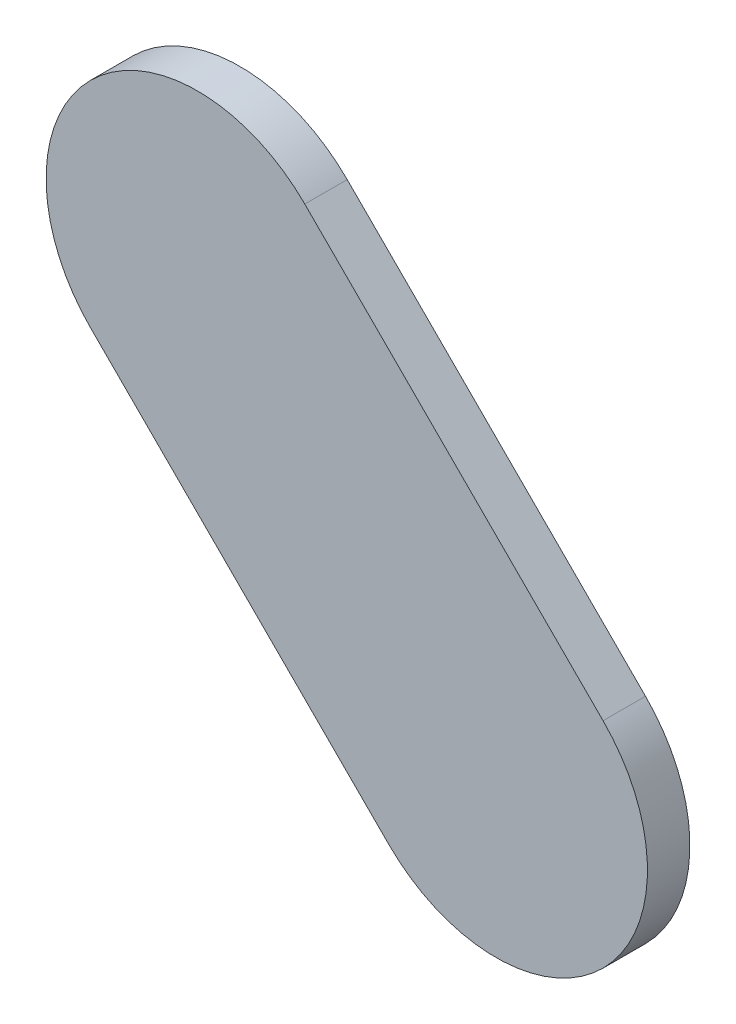
ISO-10303-21;
HEADER;
FILE_DESCRIPTION(('STEP AP214'),'2;1');
FILE_NAME('part.step','',(''),(''),'','','');
FILE_SCHEMA(('AUTOMOTIVE_DESIGN { 1 0 10303 214 1 1 1 1 }'));
ENDSEC;
DATA;
#1=APPLICATION_CONTEXT('core data for automotive mechanical design processes');
#2=APPLICATION_PROTOCOL_DEFINITION('international standard','automotive_design',2000,#1);
#3=PRODUCT_CONTEXT('',#1,'mechanical');
#4=PRODUCT('Part','Part','',(#3));
#5=PRODUCT_RELATED_PRODUCT_CATEGORY('part','',(#4));
#6=PRODUCT_DEFINITION_FORMATION('','',#4);
#7=PRODUCT_DEFINITION_CONTEXT('part definition',#1,'design');
#8=PRODUCT_DEFINITION('design','',#6,#7);
#9=PRODUCT_DEFINITION_SHAPE('','',#8);
#10=(LENGTH_UNIT() NAMED_UNIT(*) SI_UNIT(.MILLI.,.METRE.));
#11=(NAMED_UNIT(*) PLANE_ANGLE_UNIT() SI_UNIT($,.RADIAN.));
#12=(NAMED_UNIT(*) SI_UNIT($,.STERADIAN.) SOLID_ANGLE_UNIT());
#13=UNCERTAINTY_MEASURE_WITH_UNIT(LENGTH_MEASURE(1.E-05),#10,'distance_accuracy_value','');
#14=(GEOMETRIC_REPRESENTATION_CONTEXT(3) GLOBAL_UNCERTAINTY_ASSIGNED_CONTEXT((#13)) GLOBAL_UNIT_ASSIGNED_CONTEXT((#10,
#11,#12)) REPRESENTATION_CONTEXT('',''));
#15=CARTESIAN_POINT('',(0.,0.,0.));
#16=DIRECTION('',(0.,0.,1.));
#17=DIRECTION('',(1.,0.,0.));
#18=AXIS2_PLACEMENT_3D('',#15,#16,#17);
#19=CARTESIAN_POINT('',(96.02717142,86.49717016,0.));
#20=DIRECTION('',(0.707106781186527,0.707106781186568,0.));
#21=DIRECTION('',(0.707106781186568,-0.707106781186527,0.));
#22=AXIS2_PLACEMENT_3D('',#19,#20,#21);
#23=PLANE('',#22);
#24=DIRECTION('',(0.707106781186568,-0.707106781186527,0.));
#25=VECTOR('',#24,1.);
#26=CARTESIAN_POINT('',(96.02717142,86.49717016,0.03556));
#27=LINE('',#26,#25);
#28=CARTESIAN_POINT('',(96.02717142,86.49717016,0.03556));
#29=VERTEX_POINT('',#28);
#30=CARTESIAN_POINT('',(96.2771887,86.24715288,0.03556));
#31=VERTEX_POINT('',#30);
#32=EDGE_CURVE('E11',#29,#31,#27,.T.);
#33=ORIENTED_EDGE('',*,*,#32,.F.);
#34=DIRECTION('',(0.,0.,1.));
#35=VECTOR('',#34,1.);
#36=CARTESIAN_POINT('',(96.02717142,86.49717016,0.));
#37=LINE('',#36,#35);
#38=CARTESIAN_POINT('',(96.02717142,86.49717016,0.));
#39=VERTEX_POINT('',#38);
#40=EDGE_CURVE('E24',#39,#29,#37,.T.);
#41=ORIENTED_EDGE('',*,*,#40,.F.);
#42=DIRECTION('',(0.707106781186568,-0.707106781186527,0.));
#43=VECTOR('',#42,1.);
#44=CARTESIAN_POINT('',(96.02717142,86.49717016,0.));
#45=LINE('',#44,#43);
#46=CARTESIAN_POINT('',(96.2771887,86.24715288,0.));
#47=VERTEX_POINT('',#46);
#48=EDGE_CURVE('E75',#39,#47,#45,.T.);
#49=ORIENTED_EDGE('',*,*,#48,.T.);
#50=DIRECTION('',(0.,0.,1.));
#51=VECTOR('',#50,1.);
#52=CARTESIAN_POINT('',(96.2771887,86.24715288,0.));
#53=LINE('',#52,#51);
#54=EDGE_CURVE('E37',#47,#31,#53,.T.);
#55=ORIENTED_EDGE('',*,*,#54,.T.);
#56=EDGE_LOOP('',(#33,#41,#49,#55));
#57=FACE_BOUND('',#56,.T.);
#58=ADVANCED_FACE('F17',(#57),#23,.F.);
#59=CARTESIAN_POINT('',(96.3669904,86.33695458,0.));
#60=DIRECTION('',(0.,0.,-1.));
#61=DIRECTION('',(-0.707106781186548,-0.707106781186548,0.));
#62=AXIS2_PLACEMENT_3D('',#59,#60,#61);
#63=CYLINDRICAL_SURFACE('',#62,0.12699878206416);
#64=CARTESIAN_POINT('',(96.3669904,86.33695458,0.03556));
#65=DIRECTION('',(0.,0.,1.));
#66=DIRECTION('',(-0.707106781186548,-0.707106781186548,0.));
#67=AXIS2_PLACEMENT_3D('',#64,#65,#66);
#68=CIRCLE('',#67,0.12699878206416);
#69=CARTESIAN_POINT('',(96.4567921,86.42675628,0.03556));
#70=VERTEX_POINT('',#69);
#71=EDGE_CURVE('E83',#31,#70,#68,.T.);
#72=ORIENTED_EDGE('',*,*,#71,.F.);
#73=ORIENTED_EDGE('',*,*,#54,.F.);
#74=CARTESIAN_POINT('',(96.3669904,86.33695458,0.));
#75=DIRECTION('',(0.,0.,1.));
#76=DIRECTION('',(-0.707106781186548,-0.707106781186548,0.));
#77=AXIS2_PLACEMENT_3D('',#74,#75,#76);
#78=CIRCLE('',#77,0.12699878206416);
#79=CARTESIAN_POINT('',(96.4567921,86.42675628,0.));
#80=VERTEX_POINT('',#79);
#81=EDGE_CURVE('E81',#47,#80,#78,.T.);
#82=ORIENTED_EDGE('',*,*,#81,.T.);
#83=DIRECTION('',(0.,0.,1.));
#84=VECTOR('',#83,1.);
#85=CARTESIAN_POINT('',(96.4567921,86.42675628,0.));
#86=LINE('',#85,#84);
#87=EDGE_CURVE('E67',#80,#70,#86,.T.);
#88=ORIENTED_EDGE('',*,*,#87,.T.);
#89=EDGE_LOOP('',(#72,#73,#82,#88));
#90=FACE_BOUND('',#89,.T.);
#91=ADVANCED_FACE('F89',(#90),#63,.T.);
#92=CARTESIAN_POINT('',(96.4567921,86.42675628,0.));
#93=DIRECTION('',(-0.707106781186548,-0.707106781186548,0.));
#94=DIRECTION('',(-0.707106781186548,0.707106781186548,0.));
#95=AXIS2_PLACEMENT_3D('',#92,#93,#94);
#96=PLANE('',#95);
#97=DIRECTION('',(-0.707106781186548,0.707106781186548,0.));
#98=VECTOR('',#97,1.);
#99=CARTESIAN_POINT('',(96.4567921,86.42675628,0.03556));
#100=LINE('',#99,#98);
#101=CARTESIAN_POINT('',(96.20677482,86.67677356,0.03556));
#102=VERTEX_POINT('',#101);
#103=EDGE_CURVE('E71',#70,#102,#100,.T.);
#104=ORIENTED_EDGE('',*,*,#103,.F.);
#105=ORIENTED_EDGE('',*,*,#87,.F.);
#106=DIRECTION('',(-0.707106781186548,0.707106781186548,0.));
#107=VECTOR('',#106,1.);
#108=CARTESIAN_POINT('',(96.4567921,86.42675628,0.));
#109=LINE('',#108,#107);
#110=CARTESIAN_POINT('',(96.20677482,86.67677356,0.));
#111=VERTEX_POINT('',#110);
#112=EDGE_CURVE('E63',#80,#111,#109,.T.);
#113=ORIENTED_EDGE('',*,*,#112,.T.);
#114=DIRECTION('',(0.,0.,1.));
#115=VECTOR('',#114,1.);
#116=CARTESIAN_POINT('',(96.20677482,86.67677356,0.));
#117=LINE('',#116,#115);
#118=EDGE_CURVE('E53',#111,#102,#117,.T.);
#119=ORIENTED_EDGE('',*,*,#118,.T.);
#120=EDGE_LOOP('',(#104,#105,#113,#119));
#121=FACE_BOUND('',#120,.T.);
#122=ADVANCED_FACE('F66',(#121),#96,.F.);
#123=CARTESIAN_POINT('',(96.11697312,86.58697186,0.));
#124=DIRECTION('',(0.,0.,-1.));
#125=DIRECTION('',(0.707106781186604,0.707106781186492,0.));
#126=AXIS2_PLACEMENT_3D('',#123,#124,#125);
#127=CYLINDRICAL_SURFACE('',#126,0.12699878206416);
#128=CARTESIAN_POINT('',(96.11697312,86.58697186,0.03556));
#129=DIRECTION('',(0.,0.,1.));
#130=DIRECTION('',(0.707106781186604,0.707106781186492,0.));
#131=AXIS2_PLACEMENT_3D('',#128,#129,#130);
#132=CIRCLE('',#131,0.12699878206416);
#133=EDGE_CURVE('E59',#102,#29,#132,.T.);
#134=ORIENTED_EDGE('',*,*,#133,.F.);
#135=ORIENTED_EDGE('',*,*,#118,.F.);
#136=CARTESIAN_POINT('',(96.11697312,86.58697186,0.));
#137=DIRECTION('',(0.,0.,1.));
#138=DIRECTION('',(0.707106781186604,0.707106781186492,0.));
#139=AXIS2_PLACEMENT_3D('',#136,#137,#138);
#140=CIRCLE('',#139,0.12699878206416);
#141=EDGE_CURVE('E57',#111,#39,#140,.T.);
#142=ORIENTED_EDGE('',*,*,#141,.T.);
#143=ORIENTED_EDGE('',*,*,#40,.T.);
#144=EDGE_LOOP('',(#134,#135,#142,#143));
#145=FACE_BOUND('',#144,.T.);
#146=ADVANCED_FACE('F55',(#145),#127,.T.);
#147=CARTESIAN_POINT('',(96.02717142,86.49717016,0.));
#148=DIRECTION('',(0.,0.,-1.));
#149=DIRECTION('',(-1.,0.,0.));
#150=AXIS2_PLACEMENT_3D('',#147,#148,#149);
#151=PLANE('',#150);
#152=ORIENTED_EDGE('',*,*,#141,.F.);
#153=ORIENTED_EDGE('',*,*,#112,.F.);
#154=ORIENTED_EDGE('',*,*,#81,.F.);
#155=ORIENTED_EDGE('',*,*,#48,.F.);
#156=EDGE_LOOP('',(#152,#153,#154,#155));
#157=FACE_BOUND('',#156,.T.);
#158=ADVANCED_FACE('F74',(#157),#151,.T.);
#159=CARTESIAN_POINT('',(96.02717142,86.49717016,0.03556));
#160=DIRECTION('',(0.,0.,-1.));
#161=DIRECTION('',(-1.,0.,0.));
#162=AXIS2_PLACEMENT_3D('',#159,#160,#161);
#163=PLANE('',#162);
#164=ORIENTED_EDGE('',*,*,#32,.T.);
#165=ORIENTED_EDGE('',*,*,#71,.T.);
#166=ORIENTED_EDGE('',*,*,#103,.T.);
#167=ORIENTED_EDGE('',*,*,#133,.T.);
#168=EDGE_LOOP('',(#164,#165,#166,#167));
#169=FACE_BOUND('',#168,.T.);
#170=ADVANCED_FACE('F91',(#169),#163,.F.);
#171=CLOSED_SHELL('',(#58,#91,#122,#146,#158,#170));
#172=MANIFOLD_SOLID_BREP('B1',#171);
#173=ADVANCED_BREP_SHAPE_REPRESENTATION('',(#18,#172),#14);
#174=SHAPE_DEFINITION_REPRESENTATION(#9,#173);
ENDSEC;
END-ISO-10303-21;
